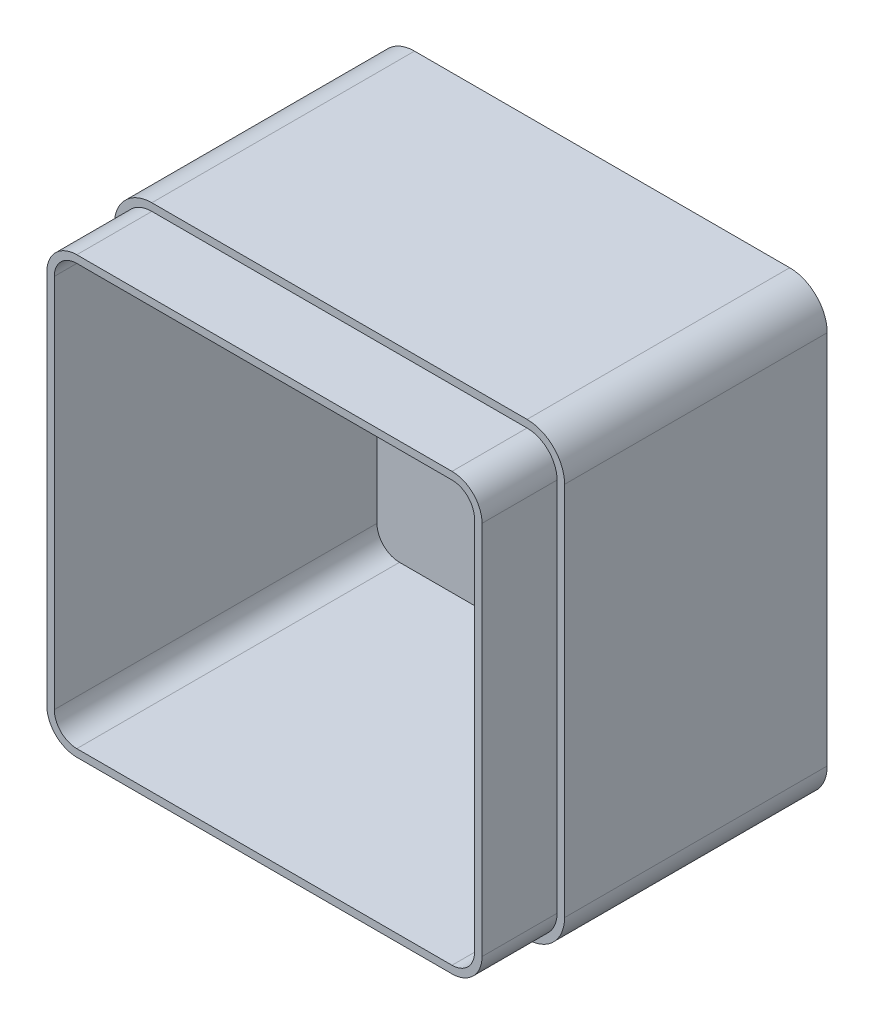
ISO-10303-21;
HEADER;
FILE_DESCRIPTION(('STEP AP214'),'2;1');
FILE_NAME('part.step','',(''),(''),'','','');
FILE_SCHEMA(('AUTOMOTIVE_DESIGN { 1 0 10303 214 1 1 1 1 }'));
ENDSEC;
DATA;
#1=APPLICATION_CONTEXT('core data for automotive mechanical design processes');
#2=APPLICATION_PROTOCOL_DEFINITION('international standard','automotive_design',2000,#1);
#3=PRODUCT_CONTEXT('',#1,'mechanical');
#4=PRODUCT('Part','Part','',(#3));
#5=PRODUCT_RELATED_PRODUCT_CATEGORY('part','',(#4));
#6=PRODUCT_DEFINITION_FORMATION('','',#4);
#7=PRODUCT_DEFINITION_CONTEXT('part definition',#1,'design');
#8=PRODUCT_DEFINITION('design','',#6,#7);
#9=PRODUCT_DEFINITION_SHAPE('','',#8);
#10=(LENGTH_UNIT() NAMED_UNIT(*) SI_UNIT(.MILLI.,.METRE.));
#11=(NAMED_UNIT(*) PLANE_ANGLE_UNIT() SI_UNIT($,.RADIAN.));
#12=(NAMED_UNIT(*) SI_UNIT($,.STERADIAN.) SOLID_ANGLE_UNIT());
#13=UNCERTAINTY_MEASURE_WITH_UNIT(LENGTH_MEASURE(1.E-05),#10,'distance_accuracy_value','');
#14=(GEOMETRIC_REPRESENTATION_CONTEXT(3) GLOBAL_UNCERTAINTY_ASSIGNED_CONTEXT((#13)) GLOBAL_UNIT_ASSIGNED_CONTEXT((#10,
#11,#12)) REPRESENTATION_CONTEXT('',''));
#15=CARTESIAN_POINT('',(0.,0.,0.));
#16=DIRECTION('',(0.,0.,1.));
#17=DIRECTION('',(1.,0.,0.));
#18=AXIS2_PLACEMENT_3D('',#15,#16,#17);
#19=CARTESIAN_POINT('',(0.,0.,90.));
#20=DIRECTION('',(0.,0.,-1.));
#21=DIRECTION('',(-1.,0.,0.));
#22=AXIS2_PLACEMENT_3D('',#19,#20,#21);
#23=PLANE('',#22);
#24=DIRECTION('',(1.,0.,0.));
#25=VECTOR('',#24,1.);
#26=CARTESIAN_POINT('',(0.,4.,90.));
#27=LINE('',#26,#25);
#28=CARTESIAN_POINT('',(10.,4.,90.));
#29=VERTEX_POINT('',#28);
#30=CARTESIAN_POINT('',(110.,4.,90.));
#31=VERTEX_POINT('',#30);
#32=EDGE_CURVE('E327',#29,#31,#27,.T.);
#33=ORIENTED_EDGE('',*,*,#32,.F.);
#34=CARTESIAN_POINT('',(10.,10.,90.));
#35=DIRECTION('',(0.,0.,-1.));
#36=DIRECTION('',(-1.,0.,0.));
#37=AXIS2_PLACEMENT_3D('',#34,#35,#36);
#38=CIRCLE('',#37,6.);
#39=CARTESIAN_POINT('',(4.,10.,90.));
#40=VERTEX_POINT('',#39);
#41=EDGE_CURVE('E328',#40,#29,#38,.F.);
#42=ORIENTED_EDGE('',*,*,#41,.F.);
#43=DIRECTION('',(0.,-1.,0.));
#44=VECTOR('',#43,1.);
#45=CARTESIAN_POINT('',(4.,0.,90.));
#46=LINE('',#45,#44);
#47=CARTESIAN_POINT('',(3.99999999999996,110.,90.));
#48=VERTEX_POINT('',#47);
#49=EDGE_CURVE('E309',#48,#40,#46,.T.);
#50=ORIENTED_EDGE('',*,*,#49,.F.);
#51=CARTESIAN_POINT('',(9.99999999999996,110.,90.));
#52=DIRECTION('',(0.,0.,-1.));
#53=DIRECTION('',(-1.,0.,0.));
#54=AXIS2_PLACEMENT_3D('',#51,#52,#53);
#55=CIRCLE('',#54,6.);
#56=CARTESIAN_POINT('',(9.99999999999996,116.,90.));
#57=VERTEX_POINT('',#56);
#58=EDGE_CURVE('E313',#57,#48,#55,.F.);
#59=ORIENTED_EDGE('',*,*,#58,.F.);
#60=DIRECTION('',(-1.,0.,0.));
#61=VECTOR('',#60,1.);
#62=CARTESIAN_POINT('',(0.,116.,90.));
#63=LINE('',#62,#61);
#64=CARTESIAN_POINT('',(110.,116.,90.));
#65=VERTEX_POINT('',#64);
#66=EDGE_CURVE('E320',#65,#57,#63,.T.);
#67=ORIENTED_EDGE('',*,*,#66,.F.);
#68=CARTESIAN_POINT('',(110.,110.,90.));
#69=DIRECTION('',(0.,0.,-1.));
#70=DIRECTION('',(-1.,0.,0.));
#71=AXIS2_PLACEMENT_3D('',#68,#69,#70);
#72=CIRCLE('',#71,6.);
#73=CARTESIAN_POINT('',(116.,110.,90.));
#74=VERTEX_POINT('',#73);
#75=EDGE_CURVE('E330',#74,#65,#72,.F.);
#76=ORIENTED_EDGE('',*,*,#75,.F.);
#77=DIRECTION('',(0.,1.,0.));
#78=VECTOR('',#77,1.);
#79=CARTESIAN_POINT('',(116.,0.,90.));
#80=LINE('',#79,#78);
#81=CARTESIAN_POINT('',(116.,10.,90.));
#82=VERTEX_POINT('',#81);
#83=EDGE_CURVE('E333',#82,#74,#80,.T.);
#84=ORIENTED_EDGE('',*,*,#83,.F.);
#85=CARTESIAN_POINT('',(110.,10.,90.));
#86=DIRECTION('',(0.,0.,-1.));
#87=DIRECTION('',(-1.,0.,0.));
#88=AXIS2_PLACEMENT_3D('',#85,#86,#87);
#89=CIRCLE('',#88,6.);
#90=EDGE_CURVE('E291',#31,#82,#89,.F.);
#91=ORIENTED_EDGE('',*,*,#90,.F.);
#92=EDGE_LOOP('',(#33,#42,#50,#59,#67,#76,#84,#91));
#93=FACE_BOUND('',#92,.T.);
#94=CARTESIAN_POINT('',(10.,10.,90.));
#95=DIRECTION('',(0.,0.,1.));
#96=DIRECTION('',(1.,0.,0.));
#97=AXIS2_PLACEMENT_3D('',#94,#95,#96);
#98=CIRCLE('',#97,8.);
#99=CARTESIAN_POINT('',(2.,9.99999999999999,90.));
#100=VERTEX_POINT('',#99);
#101=CARTESIAN_POINT('',(10.,2.,90.));
#102=VERTEX_POINT('',#101);
#103=EDGE_CURVE('E238',#100,#102,#98,.T.);
#104=ORIENTED_EDGE('',*,*,#103,.T.);
#105=DIRECTION('',(1.,0.,0.));
#106=VECTOR('',#105,1.);
#107=CARTESIAN_POINT('',(10.,2.,90.));
#108=LINE('',#107,#106);
#109=CARTESIAN_POINT('',(110.,2.,90.));
#110=VERTEX_POINT('',#109);
#111=EDGE_CURVE('E198',#102,#110,#108,.T.);
#112=ORIENTED_EDGE('',*,*,#111,.T.);
#113=CARTESIAN_POINT('',(110.,10.,90.));
#114=DIRECTION('',(0.,0.,1.));
#115=DIRECTION('',(1.,0.,0.));
#116=AXIS2_PLACEMENT_3D('',#113,#114,#115);
#117=CIRCLE('',#116,8.00000000000001);
#118=CARTESIAN_POINT('',(118.,10.,90.));
#119=VERTEX_POINT('',#118);
#120=EDGE_CURVE('E47',#110,#119,#117,.T.);
#121=ORIENTED_EDGE('',*,*,#120,.T.);
#122=DIRECTION('',(0.,1.,0.));
#123=VECTOR('',#122,1.);
#124=CARTESIAN_POINT('',(118.,10.,90.));
#125=LINE('',#124,#123);
#126=CARTESIAN_POINT('',(118.,110.,90.));
#127=VERTEX_POINT('',#126);
#128=EDGE_CURVE('E242',#119,#127,#125,.T.);
#129=ORIENTED_EDGE('',*,*,#128,.T.);
#130=CARTESIAN_POINT('',(110.,110.,90.));
#131=DIRECTION('',(0.,0.,1.));
#132=DIRECTION('',(1.,0.,0.));
#133=AXIS2_PLACEMENT_3D('',#130,#131,#132);
#134=CIRCLE('',#133,8.00000000000001);
#135=CARTESIAN_POINT('',(110.,118.,90.));
#136=VERTEX_POINT('',#135);
#137=EDGE_CURVE('E245',#127,#136,#134,.T.);
#138=ORIENTED_EDGE('',*,*,#137,.T.);
#139=DIRECTION('',(-1.,0.,0.));
#140=VECTOR('',#139,1.);
#141=CARTESIAN_POINT('',(110.,118.,90.));
#142=LINE('',#141,#140);
#143=CARTESIAN_POINT('',(9.99999999999997,118.,90.));
#144=VERTEX_POINT('',#143);
#145=EDGE_CURVE('E248',#136,#144,#142,.T.);
#146=ORIENTED_EDGE('',*,*,#145,.T.);
#147=CARTESIAN_POINT('',(9.99999999999996,110.,90.));
#148=DIRECTION('',(0.,0.,1.));
#149=DIRECTION('',(1.,0.,0.));
#150=AXIS2_PLACEMENT_3D('',#147,#148,#149);
#151=CIRCLE('',#150,8.00000000000001);
#152=CARTESIAN_POINT('',(1.99999999999995,110.,90.));
#153=VERTEX_POINT('',#152);
#154=EDGE_CURVE('E221',#144,#153,#151,.T.);
#155=ORIENTED_EDGE('',*,*,#154,.T.);
#156=DIRECTION('',(0.,-1.,0.));
#157=VECTOR('',#156,1.);
#158=CARTESIAN_POINT('',(1.99999999999996,110.,90.));
#159=LINE('',#158,#157);
#160=EDGE_CURVE('E218',#153,#100,#159,.T.);
#161=ORIENTED_EDGE('',*,*,#160,.T.);
#162=EDGE_LOOP('',(#104,#112,#121,#129,#138,#146,#155,#161));
#163=FACE_BOUND('',#162,.T.);
#164=ADVANCED_FACE('F32',(#93,#163),#23,.F.);
#165=CARTESIAN_POINT('',(4.,0.,90.));
#166=DIRECTION('',(1.,0.,0.));
#167=DIRECTION('',(0.,1.,0.));
#168=AXIS2_PLACEMENT_3D('',#165,#166,#167);
#169=PLANE('',#168);
#170=DIRECTION('',(0.,-1.,0.));
#171=VECTOR('',#170,1.);
#172=CARTESIAN_POINT('',(4.,0.,4.));
#173=LINE('',#172,#171);
#174=CARTESIAN_POINT('',(3.99999999999996,110.,4.));
#175=VERTEX_POINT('',#174);
#176=CARTESIAN_POINT('',(4.,10.,4.));
#177=VERTEX_POINT('',#176);
#178=EDGE_CURVE('E280',#175,#177,#173,.T.);
#179=ORIENTED_EDGE('',*,*,#178,.F.);
#180=DIRECTION('',(0.,0.,1.));
#181=VECTOR('',#180,1.);
#182=CARTESIAN_POINT('',(3.99999999999996,110.,90.));
#183=LINE('',#182,#181);
#184=EDGE_CURVE('E288',#48,#175,#183,.F.);
#185=ORIENTED_EDGE('',*,*,#184,.F.);
#186=ORIENTED_EDGE('',*,*,#49,.T.);
#187=DIRECTION('',(0.,0.,1.));
#188=VECTOR('',#187,1.);
#189=CARTESIAN_POINT('',(4.,10.,90.));
#190=LINE('',#189,#188);
#191=EDGE_CURVE('E284',#177,#40,#190,.T.);
#192=ORIENTED_EDGE('',*,*,#191,.F.);
#193=EDGE_LOOP('',(#179,#185,#186,#192));
#194=FACE_BOUND('',#193,.T.);
#195=ADVANCED_FACE('F425',(#194),#169,.T.);
#196=CARTESIAN_POINT('',(0.,4.,90.));
#197=DIRECTION('',(0.,1.,0.));
#198=DIRECTION('',(0.,0.,1.));
#199=AXIS2_PLACEMENT_3D('',#196,#197,#198);
#200=PLANE('',#199);
#201=DIRECTION('',(1.,0.,0.));
#202=VECTOR('',#201,1.);
#203=CARTESIAN_POINT('',(0.,4.,4.));
#204=LINE('',#203,#202);
#205=CARTESIAN_POINT('',(10.,4.,4.));
#206=VERTEX_POINT('',#205);
#207=CARTESIAN_POINT('',(110.,4.,4.));
#208=VERTEX_POINT('',#207);
#209=EDGE_CURVE('E283',#206,#208,#204,.T.);
#210=ORIENTED_EDGE('',*,*,#209,.F.);
#211=DIRECTION('',(0.,0.,1.));
#212=VECTOR('',#211,1.);
#213=CARTESIAN_POINT('',(10.,4.,90.));
#214=LINE('',#213,#212);
#215=EDGE_CURVE('E298',#29,#206,#214,.F.);
#216=ORIENTED_EDGE('',*,*,#215,.F.);
#217=ORIENTED_EDGE('',*,*,#32,.T.);
#218=DIRECTION('',(0.,0.,1.));
#219=VECTOR('',#218,1.);
#220=CARTESIAN_POINT('',(110.,4.,90.));
#221=LINE('',#220,#219);
#222=EDGE_CURVE('E311',#208,#31,#221,.T.);
#223=ORIENTED_EDGE('',*,*,#222,.F.);
#224=EDGE_LOOP('',(#210,#216,#217,#223));
#225=FACE_BOUND('',#224,.T.);
#226=ADVANCED_FACE('F430',(#225),#200,.T.);
#227=CARTESIAN_POINT('',(116.,0.,90.));
#228=DIRECTION('',(-1.,0.,0.));
#229=DIRECTION('',(0.,-1.,0.));
#230=AXIS2_PLACEMENT_3D('',#227,#228,#229);
#231=PLANE('',#230);
#232=ORIENTED_EDGE('',*,*,#83,.T.);
#233=DIRECTION('',(0.,0.,1.));
#234=VECTOR('',#233,1.);
#235=CARTESIAN_POINT('',(116.,110.,90.));
#236=LINE('',#235,#234);
#237=CARTESIAN_POINT('',(116.,110.,4.));
#238=VERTEX_POINT('',#237);
#239=EDGE_CURVE('E318',#238,#74,#236,.T.);
#240=ORIENTED_EDGE('',*,*,#239,.F.);
#241=DIRECTION('',(0.,1.,0.));
#242=VECTOR('',#241,1.);
#243=CARTESIAN_POINT('',(116.,0.,4.));
#244=LINE('',#243,#242);
#245=CARTESIAN_POINT('',(116.,10.,4.));
#246=VERTEX_POINT('',#245);
#247=EDGE_CURVE('E292',#246,#238,#244,.T.);
#248=ORIENTED_EDGE('',*,*,#247,.F.);
#249=DIRECTION('',(0.,0.,1.));
#250=VECTOR('',#249,1.);
#251=CARTESIAN_POINT('',(116.,10.,90.));
#252=LINE('',#251,#250);
#253=EDGE_CURVE('E306',#82,#246,#252,.F.);
#254=ORIENTED_EDGE('',*,*,#253,.F.);
#255=EDGE_LOOP('',(#232,#240,#248,#254));
#256=FACE_BOUND('',#255,.T.);
#257=ADVANCED_FACE('F459',(#256),#231,.T.);
#258=CARTESIAN_POINT('',(0.,116.,90.));
#259=DIRECTION('',(0.,-1.,0.));
#260=DIRECTION('',(0.,0.,-1.));
#261=AXIS2_PLACEMENT_3D('',#258,#259,#260);
#262=PLANE('',#261);
#263=ORIENTED_EDGE('',*,*,#66,.T.);
#264=DIRECTION('',(0.,0.,-1.));
#265=VECTOR('',#264,1.);
#266=CARTESIAN_POINT('',(9.99999999999996,116.,90.));
#267=LINE('',#266,#265);
#268=CARTESIAN_POINT('',(9.99999999999996,116.,4.));
#269=VERTEX_POINT('',#268);
#270=EDGE_CURVE('E287',#269,#57,#267,.F.);
#271=ORIENTED_EDGE('',*,*,#270,.F.);
#272=DIRECTION('',(-1.,0.,0.));
#273=VECTOR('',#272,1.);
#274=CARTESIAN_POINT('',(0.,116.,4.));
#275=LINE('',#274,#273);
#276=CARTESIAN_POINT('',(110.,116.,4.));
#277=VERTEX_POINT('',#276);
#278=EDGE_CURVE('E295',#277,#269,#275,.T.);
#279=ORIENTED_EDGE('',*,*,#278,.F.);
#280=DIRECTION('',(0.,0.,-1.));
#281=VECTOR('',#280,1.);
#282=CARTESIAN_POINT('',(110.,116.,90.));
#283=LINE('',#282,#281);
#284=EDGE_CURVE('E321',#65,#277,#283,.T.);
#285=ORIENTED_EDGE('',*,*,#284,.F.);
#286=EDGE_LOOP('',(#263,#271,#279,#285));
#287=FACE_BOUND('',#286,.T.);
#288=ADVANCED_FACE('F455',(#287),#262,.T.);
#289=CARTESIAN_POINT('',(0.,0.,4.));
#290=DIRECTION('',(0.,0.,-1.));
#291=DIRECTION('',(-1.,0.,0.));
#292=AXIS2_PLACEMENT_3D('',#289,#290,#291);
#293=PLANE('',#292);
#294=ORIENTED_EDGE('',*,*,#247,.T.);
#295=CARTESIAN_POINT('',(110.,110.,4.));
#296=DIRECTION('',(0.,0.,-1.));
#297=DIRECTION('',(-1.,0.,0.));
#298=AXIS2_PLACEMENT_3D('',#295,#296,#297);
#299=CIRCLE('',#298,6.);
#300=EDGE_CURVE('E303',#277,#238,#299,.T.);
#301=ORIENTED_EDGE('',*,*,#300,.F.);
#302=ORIENTED_EDGE('',*,*,#278,.T.);
#303=CARTESIAN_POINT('',(9.99999999999996,110.,4.));
#304=DIRECTION('',(0.,0.,-1.));
#305=DIRECTION('',(-1.,0.,0.));
#306=AXIS2_PLACEMENT_3D('',#303,#304,#305);
#307=CIRCLE('',#306,6.);
#308=EDGE_CURVE('E304',#175,#269,#307,.T.);
#309=ORIENTED_EDGE('',*,*,#308,.F.);
#310=ORIENTED_EDGE('',*,*,#178,.T.);
#311=CARTESIAN_POINT('',(10.,10.,4.));
#312=DIRECTION('',(0.,0.,-1.));
#313=DIRECTION('',(-1.,0.,0.));
#314=AXIS2_PLACEMENT_3D('',#311,#312,#313);
#315=CIRCLE('',#314,6.);
#316=EDGE_CURVE('E299',#206,#177,#315,.T.);
#317=ORIENTED_EDGE('',*,*,#316,.F.);
#318=ORIENTED_EDGE('',*,*,#209,.T.);
#319=CARTESIAN_POINT('',(110.,10.,4.));
#320=DIRECTION('',(0.,0.,-1.));
#321=DIRECTION('',(-1.,0.,0.));
#322=AXIS2_PLACEMENT_3D('',#319,#320,#321);
#323=CIRCLE('',#322,6.);
#324=EDGE_CURVE('E296',#246,#208,#323,.T.);
#325=ORIENTED_EDGE('',*,*,#324,.F.);
#326=EDGE_LOOP('',(#294,#301,#302,#309,#310,#317,#318,#325));
#327=FACE_BOUND('',#326,.T.);
#328=ADVANCED_FACE('F451',(#327),#293,.F.);
#329=CARTESIAN_POINT('',(110.,10.,90.));
#330=DIRECTION('',(0.,0.,-1.));
#331=DIRECTION('',(-1.,0.,0.));
#332=AXIS2_PLACEMENT_3D('',#329,#330,#331);
#333=CYLINDRICAL_SURFACE('',#332,6.);
#334=ORIENTED_EDGE('',*,*,#90,.T.);
#335=ORIENTED_EDGE('',*,*,#253,.T.);
#336=ORIENTED_EDGE('',*,*,#324,.T.);
#337=ORIENTED_EDGE('',*,*,#222,.T.);
#338=EDGE_LOOP('',(#334,#335,#336,#337));
#339=FACE_BOUND('',#338,.T.);
#340=ADVANCED_FACE('F447',(#339),#333,.F.);
#341=CARTESIAN_POINT('',(10.,10.,90.));
#342=DIRECTION('',(0.,0.,-1.));
#343=DIRECTION('',(-1.,0.,0.));
#344=AXIS2_PLACEMENT_3D('',#341,#342,#343);
#345=CYLINDRICAL_SURFACE('',#344,6.);
#346=ORIENTED_EDGE('',*,*,#41,.T.);
#347=ORIENTED_EDGE('',*,*,#215,.T.);
#348=ORIENTED_EDGE('',*,*,#316,.T.);
#349=ORIENTED_EDGE('',*,*,#191,.T.);
#350=EDGE_LOOP('',(#346,#347,#348,#349));
#351=FACE_BOUND('',#350,.T.);
#352=ADVANCED_FACE('F443',(#351),#345,.F.);
#353=CARTESIAN_POINT('',(110.,110.,90.));
#354=DIRECTION('',(0.,0.,-1.));
#355=DIRECTION('',(-1.,0.,0.));
#356=AXIS2_PLACEMENT_3D('',#353,#354,#355);
#357=CYLINDRICAL_SURFACE('',#356,6.);
#358=ORIENTED_EDGE('',*,*,#75,.T.);
#359=ORIENTED_EDGE('',*,*,#284,.T.);
#360=ORIENTED_EDGE('',*,*,#300,.T.);
#361=ORIENTED_EDGE('',*,*,#239,.T.);
#362=EDGE_LOOP('',(#358,#359,#360,#361));
#363=FACE_BOUND('',#362,.T.);
#364=ADVANCED_FACE('F439',(#363),#357,.F.);
#365=CARTESIAN_POINT('',(9.99999999999996,110.,90.));
#366=DIRECTION('',(0.,0.,-1.));
#367=DIRECTION('',(-1.,0.,0.));
#368=AXIS2_PLACEMENT_3D('',#365,#366,#367);
#369=CYLINDRICAL_SURFACE('',#368,6.);
#370=ORIENTED_EDGE('',*,*,#58,.T.);
#371=ORIENTED_EDGE('',*,*,#184,.T.);
#372=ORIENTED_EDGE('',*,*,#308,.T.);
#373=ORIENTED_EDGE('',*,*,#270,.T.);
#374=EDGE_LOOP('',(#370,#371,#372,#373));
#375=FACE_BOUND('',#374,.T.);
#376=ADVANCED_FACE('F436',(#375),#369,.F.);
#377=CARTESIAN_POINT('',(10.,10.,70.));
#378=DIRECTION('',(0.,0.,1.));
#379=DIRECTION('',(1.,0.,0.));
#380=AXIS2_PLACEMENT_3D('',#377,#378,#379);
#381=PLANE('',#380);
#382=DIRECTION('',(0.,-1.,0.));
#383=VECTOR('',#382,1.);
#384=CARTESIAN_POINT('',(1.99999999999996,110.,70.));
#385=LINE('',#384,#383);
#386=CARTESIAN_POINT('',(1.99999999999995,110.,70.));
#387=VERTEX_POINT('',#386);
#388=CARTESIAN_POINT('',(2.,9.99999999999999,70.));
#389=VERTEX_POINT('',#388);
#390=EDGE_CURVE('E204',#387,#389,#385,.T.);
#391=ORIENTED_EDGE('',*,*,#390,.F.);
#392=CARTESIAN_POINT('',(9.99999999999996,110.,70.));
#393=DIRECTION('',(0.,0.,1.));
#394=DIRECTION('',(1.,0.,0.));
#395=AXIS2_PLACEMENT_3D('',#392,#393,#394);
#396=CIRCLE('',#395,8.00000000000001);
#397=CARTESIAN_POINT('',(9.99999999999997,118.,70.));
#398=VERTEX_POINT('',#397);
#399=EDGE_CURVE('E234',#398,#387,#396,.T.);
#400=ORIENTED_EDGE('',*,*,#399,.F.);
#401=DIRECTION('',(-1.,0.,0.));
#402=VECTOR('',#401,1.);
#403=CARTESIAN_POINT('',(110.,118.,70.));
#404=LINE('',#403,#402);
#405=CARTESIAN_POINT('',(110.,118.,70.));
#406=VERTEX_POINT('',#405);
#407=EDGE_CURVE('E231',#406,#398,#404,.T.);
#408=ORIENTED_EDGE('',*,*,#407,.F.);
#409=CARTESIAN_POINT('',(110.,110.,70.));
#410=DIRECTION('',(0.,0.,1.));
#411=DIRECTION('',(1.,0.,0.));
#412=AXIS2_PLACEMENT_3D('',#409,#410,#411);
#413=CIRCLE('',#412,8.00000000000001);
#414=CARTESIAN_POINT('',(118.,110.,70.));
#415=VERTEX_POINT('',#414);
#416=EDGE_CURVE('E228',#415,#406,#413,.T.);
#417=ORIENTED_EDGE('',*,*,#416,.F.);
#418=DIRECTION('',(0.,1.,0.));
#419=VECTOR('',#418,1.);
#420=CARTESIAN_POINT('',(118.,10.,70.));
#421=LINE('',#420,#419);
#422=CARTESIAN_POINT('',(118.,10.,70.));
#423=VERTEX_POINT('',#422);
#424=EDGE_CURVE('E225',#423,#415,#421,.T.);
#425=ORIENTED_EDGE('',*,*,#424,.F.);
#426=CARTESIAN_POINT('',(110.,10.,70.));
#427=DIRECTION('',(0.,0.,1.));
#428=DIRECTION('',(1.,0.,0.));
#429=AXIS2_PLACEMENT_3D('',#426,#427,#428);
#430=CIRCLE('',#429,8.00000000000001);
#431=CARTESIAN_POINT('',(110.,2.,70.));
#432=VERTEX_POINT('',#431);
#433=EDGE_CURVE('E214',#432,#423,#430,.T.);
#434=ORIENTED_EDGE('',*,*,#433,.F.);
#435=DIRECTION('',(1.,0.,0.));
#436=VECTOR('',#435,1.);
#437=CARTESIAN_POINT('',(10.,2.,70.));
#438=LINE('',#437,#436);
#439=CARTESIAN_POINT('',(10.,2.,70.));
#440=VERTEX_POINT('',#439);
#441=EDGE_CURVE('E196',#440,#432,#438,.T.);
#442=ORIENTED_EDGE('',*,*,#441,.F.);
#443=CARTESIAN_POINT('',(10.,10.,70.));
#444=DIRECTION('',(0.,0.,1.));
#445=DIRECTION('',(1.,0.,0.));
#446=AXIS2_PLACEMENT_3D('',#443,#444,#445);
#447=CIRCLE('',#446,8.);
#448=EDGE_CURVE('E210',#389,#440,#447,.T.);
#449=ORIENTED_EDGE('',*,*,#448,.F.);
#450=EDGE_LOOP('',(#391,#400,#408,#417,#425,#434,#442,#449));
#451=FACE_BOUND('',#450,.T.);
#452=CARTESIAN_POINT('',(10.,10.,70.));
#453=DIRECTION('',(0.,0.,1.));
#454=DIRECTION('',(1.,0.,0.));
#455=AXIS2_PLACEMENT_3D('',#452,#453,#454);
#456=CIRCLE('',#455,10.);
#457=CARTESIAN_POINT('',(0.,10.,70.));
#458=VERTEX_POINT('',#457);
#459=CARTESIAN_POINT('',(10.,0.,70.));
#460=VERTEX_POINT('',#459);
#461=EDGE_CURVE('E254',#458,#460,#456,.T.);
#462=ORIENTED_EDGE('',*,*,#461,.T.);
#463=DIRECTION('',(1.,0.,0.));
#464=VECTOR('',#463,1.);
#465=CARTESIAN_POINT('',(10.,0.,70.));
#466=LINE('',#465,#464);
#467=CARTESIAN_POINT('',(110.,0.,70.));
#468=VERTEX_POINT('',#467);
#469=EDGE_CURVE('E267',#460,#468,#466,.T.);
#470=ORIENTED_EDGE('',*,*,#469,.T.);
#471=CARTESIAN_POINT('',(110.,10.,70.));
#472=DIRECTION('',(0.,0.,1.));
#473=DIRECTION('',(1.,0.,0.));
#474=AXIS2_PLACEMENT_3D('',#471,#472,#473);
#475=CIRCLE('',#474,10.);
#476=CARTESIAN_POINT('',(120.,10.,70.));
#477=VERTEX_POINT('',#476);
#478=EDGE_CURVE('E269',#468,#477,#475,.T.);
#479=ORIENTED_EDGE('',*,*,#478,.T.);
#480=DIRECTION('',(0.,1.,0.));
#481=VECTOR('',#480,1.);
#482=CARTESIAN_POINT('',(120.,10.,70.));
#483=LINE('',#482,#481);
#484=CARTESIAN_POINT('',(120.,110.,70.));
#485=VERTEX_POINT('',#484);
#486=EDGE_CURVE('E271',#477,#485,#483,.T.);
#487=ORIENTED_EDGE('',*,*,#486,.T.);
#488=CARTESIAN_POINT('',(110.,110.,70.));
#489=DIRECTION('',(0.,0.,1.));
#490=DIRECTION('',(1.,0.,0.));
#491=AXIS2_PLACEMENT_3D('',#488,#489,#490);
#492=CIRCLE('',#491,10.);
#493=CARTESIAN_POINT('',(110.,120.,70.));
#494=VERTEX_POINT('',#493);
#495=EDGE_CURVE('E273',#485,#494,#492,.T.);
#496=ORIENTED_EDGE('',*,*,#495,.T.);
#497=DIRECTION('',(-1.,0.,0.));
#498=VECTOR('',#497,1.);
#499=CARTESIAN_POINT('',(110.,120.,70.));
#500=LINE('',#499,#498);
#501=CARTESIAN_POINT('',(9.99999999999996,120.,70.));
#502=VERTEX_POINT('',#501);
#503=EDGE_CURVE('E55',#494,#502,#500,.T.);
#504=ORIENTED_EDGE('',*,*,#503,.T.);
#505=CARTESIAN_POINT('',(9.99999999999996,110.,70.));
#506=DIRECTION('',(0.,0.,1.));
#507=DIRECTION('',(1.,0.,0.));
#508=AXIS2_PLACEMENT_3D('',#505,#506,#507);
#509=CIRCLE('',#508,10.);
#510=CARTESIAN_POINT('',(0.,110.,70.));
#511=VERTEX_POINT('',#510);
#512=EDGE_CURVE('E276',#502,#511,#509,.T.);
#513=ORIENTED_EDGE('',*,*,#512,.T.);
#514=DIRECTION('',(0.,-1.,0.));
#515=VECTOR('',#514,1.);
#516=CARTESIAN_POINT('',(0.,110.,70.));
#517=LINE('',#516,#515);
#518=EDGE_CURVE('E278',#511,#458,#517,.T.);
#519=ORIENTED_EDGE('',*,*,#518,.T.);
#520=EDGE_LOOP('',(#462,#470,#479,#487,#496,#504,#513,#519));
#521=FACE_BOUND('',#520,.T.);
#522=ADVANCED_FACE('F209',(#451,#521),#381,.T.);
#523=CARTESIAN_POINT('',(10.,10.,70.));
#524=DIRECTION('',(0.,0.,1.));
#525=DIRECTION('',(1.,0.,0.));
#526=AXIS2_PLACEMENT_3D('',#523,#524,#525);
#527=CYLINDRICAL_SURFACE('',#526,8.);
#528=ORIENTED_EDGE('',*,*,#103,.F.);
#529=DIRECTION('',(0.,0.,1.));
#530=VECTOR('',#529,1.);
#531=CARTESIAN_POINT('',(2.,9.99999999999999,70.));
#532=LINE('',#531,#530);
#533=EDGE_CURVE('E217',#389,#100,#532,.T.);
#534=ORIENTED_EDGE('',*,*,#533,.F.);
#535=ORIENTED_EDGE('',*,*,#448,.T.);
#536=DIRECTION('',(0.,0.,1.));
#537=VECTOR('',#536,1.);
#538=CARTESIAN_POINT('',(10.,2.,70.));
#539=LINE('',#538,#537);
#540=EDGE_CURVE('E193',#440,#102,#539,.T.);
#541=ORIENTED_EDGE('',*,*,#540,.T.);
#542=EDGE_LOOP('',(#528,#534,#535,#541));
#543=FACE_BOUND('',#542,.T.);
#544=ADVANCED_FACE('F216',(#543),#527,.T.);
#545=CARTESIAN_POINT('',(1.99999999999996,110.,70.));
#546=DIRECTION('',(-1.,0.,0.));
#547=DIRECTION('',(0.,-1.,0.));
#548=AXIS2_PLACEMENT_3D('',#545,#546,#547);
#549=PLANE('',#548);
#550=ORIENTED_EDGE('',*,*,#160,.F.);
#551=DIRECTION('',(0.,0.,1.));
#552=VECTOR('',#551,1.);
#553=CARTESIAN_POINT('',(1.99999999999995,110.,70.));
#554=LINE('',#553,#552);
#555=EDGE_CURVE('E255',#387,#153,#554,.T.);
#556=ORIENTED_EDGE('',*,*,#555,.F.);
#557=ORIENTED_EDGE('',*,*,#390,.T.);
#558=ORIENTED_EDGE('',*,*,#533,.T.);
#559=EDGE_LOOP('',(#550,#556,#557,#558));
#560=FACE_BOUND('',#559,.T.);
#561=ADVANCED_FACE('F470',(#560),#549,.T.);
#562=CARTESIAN_POINT('',(9.99999999999996,110.,70.));
#563=DIRECTION('',(0.,0.,1.));
#564=DIRECTION('',(1.,0.,0.));
#565=AXIS2_PLACEMENT_3D('',#562,#563,#564);
#566=CYLINDRICAL_SURFACE('',#565,8.00000000000001);
#567=ORIENTED_EDGE('',*,*,#154,.F.);
#568=DIRECTION('',(0.,0.,1.));
#569=VECTOR('',#568,1.);
#570=CARTESIAN_POINT('',(9.99999999999997,118.,70.));
#571=LINE('',#570,#569);
#572=EDGE_CURVE('E257',#398,#144,#571,.T.);
#573=ORIENTED_EDGE('',*,*,#572,.F.);
#574=ORIENTED_EDGE('',*,*,#399,.T.);
#575=ORIENTED_EDGE('',*,*,#555,.T.);
#576=EDGE_LOOP('',(#567,#573,#574,#575));
#577=FACE_BOUND('',#576,.T.);
#578=ADVANCED_FACE('F485',(#577),#566,.T.);
#579=CARTESIAN_POINT('',(110.,118.,70.));
#580=DIRECTION('',(0.,1.,0.));
#581=DIRECTION('',(0.,0.,1.));
#582=AXIS2_PLACEMENT_3D('',#579,#580,#581);
#583=PLANE('',#582);
#584=ORIENTED_EDGE('',*,*,#145,.F.);
#585=DIRECTION('',(0.,0.,1.));
#586=VECTOR('',#585,1.);
#587=CARTESIAN_POINT('',(110.,118.,70.));
#588=LINE('',#587,#586);
#589=EDGE_CURVE('E259',#406,#136,#588,.T.);
#590=ORIENTED_EDGE('',*,*,#589,.F.);
#591=ORIENTED_EDGE('',*,*,#407,.T.);
#592=ORIENTED_EDGE('',*,*,#572,.T.);
#593=EDGE_LOOP('',(#584,#590,#591,#592));
#594=FACE_BOUND('',#593,.T.);
#595=ADVANCED_FACE('F481',(#594),#583,.T.);
#596=CARTESIAN_POINT('',(110.,110.,70.));
#597=DIRECTION('',(0.,0.,1.));
#598=DIRECTION('',(1.,0.,0.));
#599=AXIS2_PLACEMENT_3D('',#596,#597,#598);
#600=CYLINDRICAL_SURFACE('',#599,8.00000000000001);
#601=ORIENTED_EDGE('',*,*,#137,.F.);
#602=DIRECTION('',(0.,0.,1.));
#603=VECTOR('',#602,1.);
#604=CARTESIAN_POINT('',(118.,110.,70.));
#605=LINE('',#604,#603);
#606=EDGE_CURVE('E261',#415,#127,#605,.T.);
#607=ORIENTED_EDGE('',*,*,#606,.F.);
#608=ORIENTED_EDGE('',*,*,#416,.T.);
#609=ORIENTED_EDGE('',*,*,#589,.T.);
#610=EDGE_LOOP('',(#601,#607,#608,#609));
#611=FACE_BOUND('',#610,.T.);
#612=ADVANCED_FACE('F477',(#611),#600,.T.);
#613=CARTESIAN_POINT('',(118.,10.,70.));
#614=DIRECTION('',(1.,0.,0.));
#615=DIRECTION('',(0.,1.,0.));
#616=AXIS2_PLACEMENT_3D('',#613,#614,#615);
#617=PLANE('',#616);
#618=ORIENTED_EDGE('',*,*,#128,.F.);
#619=DIRECTION('',(0.,0.,1.));
#620=VECTOR('',#619,1.);
#621=CARTESIAN_POINT('',(118.,10.,70.));
#622=LINE('',#621,#620);
#623=EDGE_CURVE('E263',#423,#119,#622,.T.);
#624=ORIENTED_EDGE('',*,*,#623,.F.);
#625=ORIENTED_EDGE('',*,*,#424,.T.);
#626=ORIENTED_EDGE('',*,*,#606,.T.);
#627=EDGE_LOOP('',(#618,#624,#625,#626));
#628=FACE_BOUND('',#627,.T.);
#629=ADVANCED_FACE('F474',(#628),#617,.T.);
#630=CARTESIAN_POINT('',(110.,10.,70.));
#631=DIRECTION('',(0.,0.,1.));
#632=DIRECTION('',(1.,0.,0.));
#633=AXIS2_PLACEMENT_3D('',#630,#631,#632);
#634=CYLINDRICAL_SURFACE('',#633,8.00000000000001);
#635=ORIENTED_EDGE('',*,*,#120,.F.);
#636=DIRECTION('',(0.,0.,1.));
#637=VECTOR('',#636,1.);
#638=CARTESIAN_POINT('',(110.,2.,70.));
#639=LINE('',#638,#637);
#640=EDGE_CURVE('E203',#432,#110,#639,.T.);
#641=ORIENTED_EDGE('',*,*,#640,.F.);
#642=ORIENTED_EDGE('',*,*,#433,.T.);
#643=ORIENTED_EDGE('',*,*,#623,.T.);
#644=EDGE_LOOP('',(#635,#641,#642,#643));
#645=FACE_BOUND('',#644,.T.);
#646=ADVANCED_FACE('F420',(#645),#634,.T.);
#647=CARTESIAN_POINT('',(10.,2.,70.));
#648=DIRECTION('',(0.,-1.,0.));
#649=DIRECTION('',(0.,0.,-1.));
#650=AXIS2_PLACEMENT_3D('',#647,#648,#649);
#651=PLANE('',#650);
#652=ORIENTED_EDGE('',*,*,#111,.F.);
#653=ORIENTED_EDGE('',*,*,#540,.F.);
#654=ORIENTED_EDGE('',*,*,#441,.T.);
#655=ORIENTED_EDGE('',*,*,#640,.T.);
#656=EDGE_LOOP('',(#652,#653,#654,#655));
#657=FACE_BOUND('',#656,.T.);
#658=ADVANCED_FACE('F195',(#657),#651,.T.);
#659=CARTESIAN_POINT('',(0.,0.,0.));
#660=DIRECTION('',(0.,0.,-1.));
#661=DIRECTION('',(-1.,0.,0.));
#662=AXIS2_PLACEMENT_3D('',#659,#660,#661);
#663=PLANE('',#662);
#664=DIRECTION('',(0.,1.,0.));
#665=VECTOR('',#664,1.);
#666=CARTESIAN_POINT('',(120.,0.,0.));
#667=LINE('',#666,#665);
#668=CARTESIAN_POINT('',(120.,10.,0.));
#669=VERTEX_POINT('',#668);
#670=CARTESIAN_POINT('',(120.,110.,0.));
#671=VERTEX_POINT('',#670);
#672=EDGE_CURVE('E346',#669,#671,#667,.T.);
#673=ORIENTED_EDGE('',*,*,#672,.F.);
#674=CARTESIAN_POINT('',(110.,10.,0.));
#675=DIRECTION('',(0.,0.,-1.));
#676=DIRECTION('',(-1.,0.,0.));
#677=AXIS2_PLACEMENT_3D('',#674,#675,#676);
#678=CIRCLE('',#677,10.);
#679=CARTESIAN_POINT('',(110.,0.,0.));
#680=VERTEX_POINT('',#679);
#681=EDGE_CURVE('E363',#669,#680,#678,.T.);
#682=ORIENTED_EDGE('',*,*,#681,.T.);
#683=DIRECTION('',(1.,0.,0.));
#684=VECTOR('',#683,1.);
#685=CARTESIAN_POINT('',(0.,0.,0.));
#686=LINE('',#685,#684);
#687=CARTESIAN_POINT('',(10.,0.,0.));
#688=VERTEX_POINT('',#687);
#689=EDGE_CURVE('E343',#688,#680,#686,.T.);
#690=ORIENTED_EDGE('',*,*,#689,.F.);
#691=CARTESIAN_POINT('',(10.,10.,0.));
#692=DIRECTION('',(0.,0.,-1.));
#693=DIRECTION('',(-1.,0.,0.));
#694=AXIS2_PLACEMENT_3D('',#691,#692,#693);
#695=CIRCLE('',#694,10.);
#696=CARTESIAN_POINT('',(0.,10.,0.));
#697=VERTEX_POINT('',#696);
#698=EDGE_CURVE('E361',#688,#697,#695,.T.);
#699=ORIENTED_EDGE('',*,*,#698,.T.);
#700=DIRECTION('',(0.,-1.,0.));
#701=VECTOR('',#700,1.);
#702=CARTESIAN_POINT('',(0.,0.,0.));
#703=LINE('',#702,#701);
#704=CARTESIAN_POINT('',(0.,110.,0.));
#705=VERTEX_POINT('',#704);
#706=EDGE_CURVE('E324',#705,#697,#703,.T.);
#707=ORIENTED_EDGE('',*,*,#706,.F.);
#708=CARTESIAN_POINT('',(9.99999999999996,110.,0.));
#709=DIRECTION('',(0.,0.,-1.));
#710=DIRECTION('',(-1.,0.,0.));
#711=AXIS2_PLACEMENT_3D('',#708,#709,#710);
#712=CIRCLE('',#711,10.);
#713=CARTESIAN_POINT('',(9.99999999999996,120.,0.));
#714=VERTEX_POINT('',#713);
#715=EDGE_CURVE('E357',#705,#714,#712,.T.);
#716=ORIENTED_EDGE('',*,*,#715,.T.);
#717=DIRECTION('',(-1.,0.,0.));
#718=VECTOR('',#717,1.);
#719=CARTESIAN_POINT('',(0.,120.,0.));
#720=LINE('',#719,#718);
#721=CARTESIAN_POINT('',(110.,120.,0.));
#722=VERTEX_POINT('',#721);
#723=EDGE_CURVE('E349',#722,#714,#720,.T.);
#724=ORIENTED_EDGE('',*,*,#723,.F.);
#725=CARTESIAN_POINT('',(110.,110.,0.));
#726=DIRECTION('',(0.,0.,-1.));
#727=DIRECTION('',(-1.,0.,0.));
#728=AXIS2_PLACEMENT_3D('',#725,#726,#727);
#729=CIRCLE('',#728,10.);
#730=EDGE_CURVE('E359',#722,#671,#729,.T.);
#731=ORIENTED_EDGE('',*,*,#730,.T.);
#732=EDGE_LOOP('',(#673,#682,#690,#699,#707,#716,#724,#731));
#733=FACE_BOUND('',#732,.T.);
#734=ADVANCED_FACE('F413',(#733),#663,.T.);
#735=CARTESIAN_POINT('',(9.99999999999996,110.,90.));
#736=DIRECTION('',(0.,0.,-1.));
#737=DIRECTION('',(-1.,0.,0.));
#738=AXIS2_PLACEMENT_3D('',#735,#736,#737);
#739=CYLINDRICAL_SURFACE('',#738,10.);
#740=DIRECTION('',(0.,0.,-1.));
#741=VECTOR('',#740,1.);
#742=CARTESIAN_POINT('',(0.,110.,90.));
#743=LINE('',#742,#741);
#744=EDGE_CURVE('E370',#511,#705,#743,.T.);
#745=ORIENTED_EDGE('',*,*,#744,.F.);
#746=ORIENTED_EDGE('',*,*,#512,.F.);
#747=DIRECTION('',(0.,0.,-1.));
#748=VECTOR('',#747,1.);
#749=CARTESIAN_POINT('',(9.99999999999996,120.,90.));
#750=LINE('',#749,#748);
#751=EDGE_CURVE('E40',#714,#502,#750,.F.);
#752=ORIENTED_EDGE('',*,*,#751,.F.);
#753=ORIENTED_EDGE('',*,*,#715,.F.);
#754=EDGE_LOOP('',(#745,#746,#752,#753));
#755=FACE_BOUND('',#754,.T.);
#756=ADVANCED_FACE('F34',(#755),#739,.T.);
#757=CARTESIAN_POINT('',(110.,110.,90.));
#758=DIRECTION('',(0.,0.,-1.));
#759=DIRECTION('',(-1.,0.,0.));
#760=AXIS2_PLACEMENT_3D('',#757,#758,#759);
#761=CYLINDRICAL_SURFACE('',#760,10.);
#762=DIRECTION('',(0.,0.,-1.));
#763=VECTOR('',#762,1.);
#764=CARTESIAN_POINT('',(110.,120.,90.));
#765=LINE('',#764,#763);
#766=EDGE_CURVE('E11',#494,#722,#765,.T.);
#767=ORIENTED_EDGE('',*,*,#766,.F.);
#768=ORIENTED_EDGE('',*,*,#495,.F.);
#769=DIRECTION('',(0.,0.,-1.));
#770=VECTOR('',#769,1.);
#771=CARTESIAN_POINT('',(120.,110.,90.));
#772=LINE('',#771,#770);
#773=EDGE_CURVE('E352',#671,#485,#772,.F.);
#774=ORIENTED_EDGE('',*,*,#773,.F.);
#775=ORIENTED_EDGE('',*,*,#730,.F.);
#776=EDGE_LOOP('',(#767,#768,#774,#775));
#777=FACE_BOUND('',#776,.T.);
#778=ADVANCED_FACE('F411',(#777),#761,.T.);
#779=CARTESIAN_POINT('',(0.,120.,90.));
#780=DIRECTION('',(0.,-1.,0.));
#781=DIRECTION('',(0.,0.,-1.));
#782=AXIS2_PLACEMENT_3D('',#779,#780,#781);
#783=PLANE('',#782);
#784=ORIENTED_EDGE('',*,*,#503,.F.);
#785=ORIENTED_EDGE('',*,*,#766,.T.);
#786=ORIENTED_EDGE('',*,*,#723,.T.);
#787=ORIENTED_EDGE('',*,*,#751,.T.);
#788=EDGE_LOOP('',(#784,#785,#786,#787));
#789=FACE_BOUND('',#788,.T.);
#790=ADVANCED_FACE('F377',(#789),#783,.F.);
#791=CARTESIAN_POINT('',(110.,10.,90.));
#792=DIRECTION('',(0.,0.,-1.));
#793=DIRECTION('',(-1.,0.,0.));
#794=AXIS2_PLACEMENT_3D('',#791,#792,#793);
#795=CYLINDRICAL_SURFACE('',#794,10.);
#796=DIRECTION('',(0.,0.,-1.));
#797=VECTOR('',#796,1.);
#798=CARTESIAN_POINT('',(120.,10.,90.));
#799=LINE('',#798,#797);
#800=EDGE_CURVE('E355',#477,#669,#799,.T.);
#801=ORIENTED_EDGE('',*,*,#800,.F.);
#802=ORIENTED_EDGE('',*,*,#478,.F.);
#803=DIRECTION('',(0.,0.,-1.));
#804=VECTOR('',#803,1.);
#805=CARTESIAN_POINT('',(110.,0.,90.));
#806=LINE('',#805,#804);
#807=EDGE_CURVE('E367',#680,#468,#806,.F.);
#808=ORIENTED_EDGE('',*,*,#807,.F.);
#809=ORIENTED_EDGE('',*,*,#681,.F.);
#810=EDGE_LOOP('',(#801,#802,#808,#809));
#811=FACE_BOUND('',#810,.T.);
#812=ADVANCED_FACE('F402',(#811),#795,.T.);
#813=CARTESIAN_POINT('',(120.,0.,90.));
#814=DIRECTION('',(-1.,0.,0.));
#815=DIRECTION('',(0.,-1.,0.));
#816=AXIS2_PLACEMENT_3D('',#813,#814,#815);
#817=PLANE('',#816);
#818=ORIENTED_EDGE('',*,*,#486,.F.);
#819=ORIENTED_EDGE('',*,*,#800,.T.);
#820=ORIENTED_EDGE('',*,*,#672,.T.);
#821=ORIENTED_EDGE('',*,*,#773,.T.);
#822=EDGE_LOOP('',(#818,#819,#820,#821));
#823=FACE_BOUND('',#822,.T.);
#824=ADVANCED_FACE('F407',(#823),#817,.F.);
#825=CARTESIAN_POINT('',(10.,10.,90.));
#826=DIRECTION('',(0.,0.,-1.));
#827=DIRECTION('',(-1.,0.,0.));
#828=AXIS2_PLACEMENT_3D('',#825,#826,#827);
#829=CYLINDRICAL_SURFACE('',#828,10.);
#830=DIRECTION('',(0.,0.,-1.));
#831=VECTOR('',#830,1.);
#832=CARTESIAN_POINT('',(10.,0.,90.));
#833=LINE('',#832,#831);
#834=EDGE_CURVE('E365',#460,#688,#833,.T.);
#835=ORIENTED_EDGE('',*,*,#834,.F.);
#836=ORIENTED_EDGE('',*,*,#461,.F.);
#837=DIRECTION('',(0.,0.,-1.));
#838=VECTOR('',#837,1.);
#839=CARTESIAN_POINT('',(0.,10.,90.));
#840=LINE('',#839,#838);
#841=EDGE_CURVE('E372',#697,#458,#840,.F.);
#842=ORIENTED_EDGE('',*,*,#841,.F.);
#843=ORIENTED_EDGE('',*,*,#698,.F.);
#844=EDGE_LOOP('',(#835,#836,#842,#843));
#845=FACE_BOUND('',#844,.T.);
#846=ADVANCED_FACE('F392',(#845),#829,.T.);
#847=CARTESIAN_POINT('',(0.,0.,90.));
#848=DIRECTION('',(0.,1.,0.));
#849=DIRECTION('',(0.,0.,1.));
#850=AXIS2_PLACEMENT_3D('',#847,#848,#849);
#851=PLANE('',#850);
#852=ORIENTED_EDGE('',*,*,#469,.F.);
#853=ORIENTED_EDGE('',*,*,#834,.T.);
#854=ORIENTED_EDGE('',*,*,#689,.T.);
#855=ORIENTED_EDGE('',*,*,#807,.T.);
#856=EDGE_LOOP('',(#852,#853,#854,#855));
#857=FACE_BOUND('',#856,.T.);
#858=ADVANCED_FACE('F397',(#857),#851,.F.);
#859=CARTESIAN_POINT('',(0.,0.,90.));
#860=DIRECTION('',(1.,0.,0.));
#861=DIRECTION('',(0.,1.,0.));
#862=AXIS2_PLACEMENT_3D('',#859,#860,#861);
#863=PLANE('',#862);
#864=ORIENTED_EDGE('',*,*,#518,.F.);
#865=ORIENTED_EDGE('',*,*,#744,.T.);
#866=ORIENTED_EDGE('',*,*,#706,.T.);
#867=ORIENTED_EDGE('',*,*,#841,.T.);
#868=EDGE_LOOP('',(#864,#865,#866,#867));
#869=FACE_BOUND('',#868,.T.);
#870=ADVANCED_FACE('F387',(#869),#863,.F.);
#871=CLOSED_SHELL('',(#164,#195,#226,#257,#288,#328,#340,#352,#364,#376,#522,#544,#561,#578,
#595,#612,#629,#646,#658,#734,#756,#778,#790,#812,#824,#846,#858,#870));
#872=MANIFOLD_SOLID_BREP('B2',#871);
#873=ADVANCED_BREP_SHAPE_REPRESENTATION('',(#18,#872),#14);
#874=SHAPE_DEFINITION_REPRESENTATION(#9,#873);
ENDSEC;
END-ISO-10303-21;
